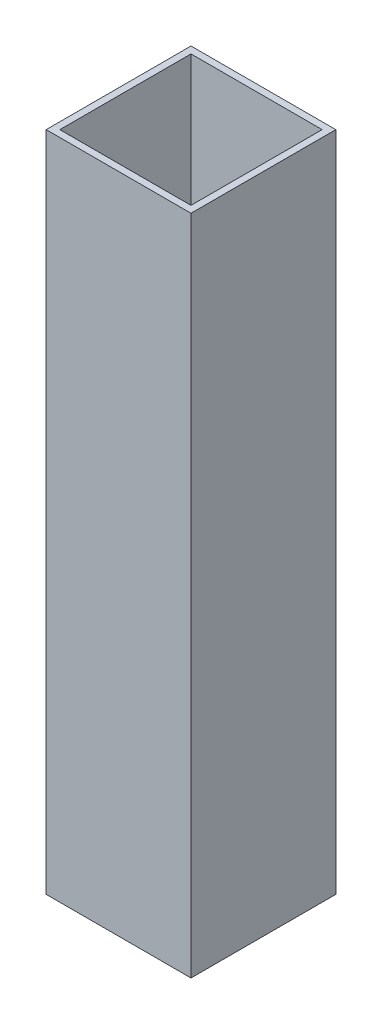
ISO-10303-21;
HEADER;
FILE_DESCRIPTION(('STEP AP214'),'2;1');
FILE_NAME('part.step','',(''),(''),'','','');
FILE_SCHEMA(('AUTOMOTIVE_DESIGN { 1 0 10303 214 1 1 1 1 }'));
ENDSEC;
DATA;
#1=APPLICATION_CONTEXT('core data for automotive mechanical design processes');
#2=APPLICATION_PROTOCOL_DEFINITION('international standard','automotive_design',2000,#1);
#3=PRODUCT_CONTEXT('',#1,'mechanical');
#4=PRODUCT('Part','Part','',(#3));
#5=PRODUCT_RELATED_PRODUCT_CATEGORY('part','',(#4));
#6=PRODUCT_DEFINITION_FORMATION('','',#4);
#7=PRODUCT_DEFINITION_CONTEXT('part definition',#1,'design');
#8=PRODUCT_DEFINITION('design','',#6,#7);
#9=PRODUCT_DEFINITION_SHAPE('','',#8);
#10=(LENGTH_UNIT() NAMED_UNIT(*) SI_UNIT(.MILLI.,.METRE.));
#11=(NAMED_UNIT(*) PLANE_ANGLE_UNIT() SI_UNIT($,.RADIAN.));
#12=(NAMED_UNIT(*) SI_UNIT($,.STERADIAN.) SOLID_ANGLE_UNIT());
#13=UNCERTAINTY_MEASURE_WITH_UNIT(LENGTH_MEASURE(1.E-05),#10,'distance_accuracy_value','');
#14=(GEOMETRIC_REPRESENTATION_CONTEXT(3) GLOBAL_UNCERTAINTY_ASSIGNED_CONTEXT((#13)) GLOBAL_UNIT_ASSIGNED_CONTEXT((#10,
#11,#12)) REPRESENTATION_CONTEXT('',''));
#15=CARTESIAN_POINT('',(0.,0.,0.));
#16=DIRECTION('',(0.,0.,1.));
#17=DIRECTION('',(1.,0.,0.));
#18=AXIS2_PLACEMENT_3D('',#15,#16,#17);
#19=CARTESIAN_POINT('',(0.,116.14,0.));
#20=DIRECTION('',(0.,1.,0.));
#21=DIRECTION('',(0.,0.,1.));
#22=AXIS2_PLACEMENT_3D('',#19,#20,#21);
#23=PLANE('',#22);
#24=DIRECTION('',(0.,0.,1.));
#25=VECTOR('',#24,1.);
#26=CARTESIAN_POINT('',(0.,116.14,-25.4));
#27=LINE('',#26,#25);
#28=CARTESIAN_POINT('',(0.,116.14,-25.4));
#29=VERTEX_POINT('',#28);
#30=CARTESIAN_POINT('',(0.,116.14,0.));
#31=VERTEX_POINT('',#30);
#32=EDGE_CURVE('E157',#29,#31,#27,.T.);
#33=ORIENTED_EDGE('',*,*,#32,.T.);
#34=DIRECTION('',(1.,0.,0.));
#35=VECTOR('',#34,1.);
#36=CARTESIAN_POINT('',(0.,116.14,0.));
#37=LINE('',#36,#35);
#38=CARTESIAN_POINT('',(25.4,116.14,0.));
#39=VERTEX_POINT('',#38);
#40=EDGE_CURVE('E161',#31,#39,#37,.T.);
#41=ORIENTED_EDGE('',*,*,#40,.T.);
#42=DIRECTION('',(0.,0.,-1.));
#43=VECTOR('',#42,1.);
#44=CARTESIAN_POINT('',(25.4,116.14,0.));
#45=LINE('',#44,#43);
#46=CARTESIAN_POINT('',(25.4,116.14,-25.4));
#47=VERTEX_POINT('',#46);
#48=EDGE_CURVE('E165',#39,#47,#45,.T.);
#49=ORIENTED_EDGE('',*,*,#48,.T.);
#50=DIRECTION('',(-1.,0.,0.));
#51=VECTOR('',#50,1.);
#52=CARTESIAN_POINT('',(25.4,116.14,-25.4));
#53=LINE('',#52,#51);
#54=EDGE_CURVE('E168',#47,#29,#53,.T.);
#55=ORIENTED_EDGE('',*,*,#54,.T.);
#56=EDGE_LOOP('',(#33,#41,#49,#55));
#57=FACE_BOUND('',#56,.T.);
#58=DIRECTION('',(0.,0.,1.));
#59=VECTOR('',#58,1.);
#60=CARTESIAN_POINT('',(1.2,116.14,-24.2));
#61=LINE('',#60,#59);
#62=CARTESIAN_POINT('',(1.2,116.14,-24.2));
#63=VERTEX_POINT('',#62);
#64=CARTESIAN_POINT('',(1.2,116.14,-1.2));
#65=VERTEX_POINT('',#64);
#66=EDGE_CURVE('E118',#63,#65,#61,.T.);
#67=ORIENTED_EDGE('',*,*,#66,.F.);
#68=DIRECTION('',(-1.,0.,0.));
#69=VECTOR('',#68,1.);
#70=CARTESIAN_POINT('',(24.2,116.14,-24.2));
#71=LINE('',#70,#69);
#72=CARTESIAN_POINT('',(24.2,116.14,-24.2));
#73=VERTEX_POINT('',#72);
#74=EDGE_CURVE('E109',#73,#63,#71,.T.);
#75=ORIENTED_EDGE('',*,*,#74,.F.);
#76=DIRECTION('',(0.,0.,-1.));
#77=VECTOR('',#76,1.);
#78=CARTESIAN_POINT('',(24.2,116.14,-1.2));
#79=LINE('',#78,#77);
#80=CARTESIAN_POINT('',(24.2,116.14,-1.2));
#81=VERTEX_POINT('',#80);
#82=EDGE_CURVE('E135',#81,#73,#79,.T.);
#83=ORIENTED_EDGE('',*,*,#82,.F.);
#84=DIRECTION('',(1.,0.,0.));
#85=VECTOR('',#84,1.);
#86=CARTESIAN_POINT('',(1.2,116.14,-1.2));
#87=LINE('',#86,#85);
#88=EDGE_CURVE('E131',#65,#81,#87,.T.);
#89=ORIENTED_EDGE('',*,*,#88,.F.);
#90=EDGE_LOOP('',(#67,#75,#83,#89));
#91=FACE_BOUND('',#90,.T.);
#92=ADVANCED_FACE('F43',(#57,#91),#23,.T.);
#93=CARTESIAN_POINT('',(0.,0.,0.));
#94=DIRECTION('',(0.,1.,0.));
#95=DIRECTION('',(0.,0.,1.));
#96=AXIS2_PLACEMENT_3D('',#93,#94,#95);
#97=PLANE('',#96);
#98=DIRECTION('',(0.,0.,1.));
#99=VECTOR('',#98,1.);
#100=CARTESIAN_POINT('',(0.,0.,-25.4));
#101=LINE('',#100,#99);
#102=CARTESIAN_POINT('',(0.,0.,-25.4));
#103=VERTEX_POINT('',#102);
#104=CARTESIAN_POINT('',(0.,0.,0.));
#105=VERTEX_POINT('',#104);
#106=EDGE_CURVE('E127',#103,#105,#101,.T.);
#107=ORIENTED_EDGE('',*,*,#106,.F.);
#108=DIRECTION('',(-1.,0.,0.));
#109=VECTOR('',#108,1.);
#110=CARTESIAN_POINT('',(25.4,0.,-25.4));
#111=LINE('',#110,#109);
#112=CARTESIAN_POINT('',(25.4,0.,-25.4));
#113=VERTEX_POINT('',#112);
#114=EDGE_CURVE('E162',#113,#103,#111,.T.);
#115=ORIENTED_EDGE('',*,*,#114,.F.);
#116=DIRECTION('',(0.,0.,-1.));
#117=VECTOR('',#116,1.);
#118=CARTESIAN_POINT('',(25.4,0.,0.));
#119=LINE('',#118,#117);
#120=CARTESIAN_POINT('',(25.4,0.,0.));
#121=VERTEX_POINT('',#120);
#122=EDGE_CURVE('E178',#121,#113,#119,.T.);
#123=ORIENTED_EDGE('',*,*,#122,.F.);
#124=DIRECTION('',(1.,0.,0.));
#125=VECTOR('',#124,1.);
#126=CARTESIAN_POINT('',(0.,0.,0.));
#127=LINE('',#126,#125);
#128=EDGE_CURVE('E175',#105,#121,#127,.T.);
#129=ORIENTED_EDGE('',*,*,#128,.F.);
#130=EDGE_LOOP('',(#107,#115,#123,#129));
#131=FACE_BOUND('',#130,.T.);
#132=DIRECTION('',(-1.,0.,0.));
#133=VECTOR('',#132,1.);
#134=CARTESIAN_POINT('',(24.2,0.,-24.2));
#135=LINE('',#134,#133);
#136=CARTESIAN_POINT('',(24.2,0.,-24.2));
#137=VERTEX_POINT('',#136);
#138=CARTESIAN_POINT('',(1.2,0.,-24.2));
#139=VERTEX_POINT('',#138);
#140=EDGE_CURVE('E67',#137,#139,#135,.T.);
#141=ORIENTED_EDGE('',*,*,#140,.T.);
#142=DIRECTION('',(0.,0.,1.));
#143=VECTOR('',#142,1.);
#144=CARTESIAN_POINT('',(1.2,0.,-24.2));
#145=LINE('',#144,#143);
#146=CARTESIAN_POINT('',(1.2,0.,-1.2));
#147=VERTEX_POINT('',#146);
#148=EDGE_CURVE('E125',#139,#147,#145,.T.);
#149=ORIENTED_EDGE('',*,*,#148,.T.);
#150=DIRECTION('',(1.,0.,0.));
#151=VECTOR('',#150,1.);
#152=CARTESIAN_POINT('',(1.2,0.,-1.2));
#153=LINE('',#152,#151);
#154=CARTESIAN_POINT('',(24.2,0.,-1.2));
#155=VERTEX_POINT('',#154);
#156=EDGE_CURVE('E144',#147,#155,#153,.T.);
#157=ORIENTED_EDGE('',*,*,#156,.T.);
#158=DIRECTION('',(0.,0.,-1.));
#159=VECTOR('',#158,1.);
#160=CARTESIAN_POINT('',(24.2,0.,-1.2));
#161=LINE('',#160,#159);
#162=EDGE_CURVE('E119',#155,#137,#161,.T.);
#163=ORIENTED_EDGE('',*,*,#162,.T.);
#164=EDGE_LOOP('',(#141,#149,#157,#163));
#165=FACE_BOUND('',#164,.T.);
#166=ADVANCED_FACE('F201',(#131,#165),#97,.F.);
#167=CARTESIAN_POINT('',(0.,116.14,-25.4));
#168=DIRECTION('',(1.,0.,0.));
#169=DIRECTION('',(0.,0.,-1.));
#170=AXIS2_PLACEMENT_3D('',#167,#168,#169);
#171=PLANE('',#170);
#172=ORIENTED_EDGE('',*,*,#106,.T.);
#173=DIRECTION('',(0.,-1.,0.));
#174=VECTOR('',#173,1.);
#175=CARTESIAN_POINT('',(0.,116.14,0.));
#176=LINE('',#175,#174);
#177=EDGE_CURVE('E11',#31,#105,#176,.T.);
#178=ORIENTED_EDGE('',*,*,#177,.F.);
#179=ORIENTED_EDGE('',*,*,#32,.F.);
#180=DIRECTION('',(0.,-1.,0.));
#181=VECTOR('',#180,1.);
#182=CARTESIAN_POINT('',(0.,116.14,-25.4));
#183=LINE('',#182,#181);
#184=EDGE_CURVE('E171',#29,#103,#183,.T.);
#185=ORIENTED_EDGE('',*,*,#184,.T.);
#186=EDGE_LOOP('',(#172,#178,#179,#185));
#187=FACE_BOUND('',#186,.T.);
#188=ADVANCED_FACE('F45',(#187),#171,.F.);
#189=CARTESIAN_POINT('',(0.,116.14,0.));
#190=DIRECTION('',(0.,0.,-1.));
#191=DIRECTION('',(-1.,0.,0.));
#192=AXIS2_PLACEMENT_3D('',#189,#190,#191);
#193=PLANE('',#192);
#194=ORIENTED_EDGE('',*,*,#128,.T.);
#195=DIRECTION('',(0.,-1.,0.));
#196=VECTOR('',#195,1.);
#197=CARTESIAN_POINT('',(25.4,116.14,0.));
#198=LINE('',#197,#196);
#199=EDGE_CURVE('E52',#39,#121,#198,.T.);
#200=ORIENTED_EDGE('',*,*,#199,.F.);
#201=ORIENTED_EDGE('',*,*,#40,.F.);
#202=ORIENTED_EDGE('',*,*,#177,.T.);
#203=EDGE_LOOP('',(#194,#200,#201,#202));
#204=FACE_BOUND('',#203,.T.);
#205=ADVANCED_FACE('F211',(#204),#193,.F.);
#206=CARTESIAN_POINT('',(25.4,116.14,0.));
#207=DIRECTION('',(-1.,0.,0.));
#208=DIRECTION('',(0.,0.,1.));
#209=AXIS2_PLACEMENT_3D('',#206,#207,#208);
#210=PLANE('',#209);
#211=ORIENTED_EDGE('',*,*,#122,.T.);
#212=DIRECTION('',(0.,-1.,0.));
#213=VECTOR('',#212,1.);
#214=CARTESIAN_POINT('',(25.4,116.14,-25.4));
#215=LINE('',#214,#213);
#216=EDGE_CURVE('E186',#47,#113,#215,.T.);
#217=ORIENTED_EDGE('',*,*,#216,.F.);
#218=ORIENTED_EDGE('',*,*,#48,.F.);
#219=ORIENTED_EDGE('',*,*,#199,.T.);
#220=EDGE_LOOP('',(#211,#217,#218,#219));
#221=FACE_BOUND('',#220,.T.);
#222=ADVANCED_FACE('F195',(#221),#210,.F.);
#223=CARTESIAN_POINT('',(25.4,116.14,-25.4));
#224=DIRECTION('',(0.,0.,1.));
#225=DIRECTION('',(1.,0.,0.));
#226=AXIS2_PLACEMENT_3D('',#223,#224,#225);
#227=PLANE('',#226);
#228=ORIENTED_EDGE('',*,*,#114,.T.);
#229=ORIENTED_EDGE('',*,*,#184,.F.);
#230=ORIENTED_EDGE('',*,*,#54,.F.);
#231=ORIENTED_EDGE('',*,*,#216,.T.);
#232=EDGE_LOOP('',(#228,#229,#230,#231));
#233=FACE_BOUND('',#232,.T.);
#234=ADVANCED_FACE('F205',(#233),#227,.F.);
#235=CARTESIAN_POINT('',(24.2,116.14,-24.2));
#236=DIRECTION('',(0.,0.,1.));
#237=DIRECTION('',(1.,0.,0.));
#238=AXIS2_PLACEMENT_3D('',#235,#236,#237);
#239=PLANE('',#238);
#240=ORIENTED_EDGE('',*,*,#140,.F.);
#241=DIRECTION('',(0.,-1.,0.));
#242=VECTOR('',#241,1.);
#243=CARTESIAN_POINT('',(24.2,116.14,-24.2));
#244=LINE('',#243,#242);
#245=EDGE_CURVE('E113',#73,#137,#244,.T.);
#246=ORIENTED_EDGE('',*,*,#245,.F.);
#247=ORIENTED_EDGE('',*,*,#74,.T.);
#248=DIRECTION('',(0.,-1.,0.));
#249=VECTOR('',#248,1.);
#250=CARTESIAN_POINT('',(1.2,116.14,-24.2));
#251=LINE('',#250,#249);
#252=EDGE_CURVE('E112',#63,#139,#251,.T.);
#253=ORIENTED_EDGE('',*,*,#252,.T.);
#254=EDGE_LOOP('',(#240,#246,#247,#253));
#255=FACE_BOUND('',#254,.T.);
#256=ADVANCED_FACE('F111',(#255),#239,.T.);
#257=CARTESIAN_POINT('',(1.2,116.14,-24.2));
#258=DIRECTION('',(1.,0.,0.));
#259=DIRECTION('',(0.,0.,-1.));
#260=AXIS2_PLACEMENT_3D('',#257,#258,#259);
#261=PLANE('',#260);
#262=ORIENTED_EDGE('',*,*,#148,.F.);
#263=ORIENTED_EDGE('',*,*,#252,.F.);
#264=ORIENTED_EDGE('',*,*,#66,.T.);
#265=DIRECTION('',(0.,-1.,0.));
#266=VECTOR('',#265,1.);
#267=CARTESIAN_POINT('',(1.2,116.14,-1.2));
#268=LINE('',#267,#266);
#269=EDGE_CURVE('E128',#65,#147,#268,.T.);
#270=ORIENTED_EDGE('',*,*,#269,.T.);
#271=EDGE_LOOP('',(#262,#263,#264,#270));
#272=FACE_BOUND('',#271,.T.);
#273=ADVANCED_FACE('F122',(#272),#261,.T.);
#274=CARTESIAN_POINT('',(1.2,116.14,-1.2));
#275=DIRECTION('',(0.,0.,-1.));
#276=DIRECTION('',(-1.,0.,0.));
#277=AXIS2_PLACEMENT_3D('',#274,#275,#276);
#278=PLANE('',#277);
#279=ORIENTED_EDGE('',*,*,#156,.F.);
#280=ORIENTED_EDGE('',*,*,#269,.F.);
#281=ORIENTED_EDGE('',*,*,#88,.T.);
#282=DIRECTION('',(0.,-1.,0.));
#283=VECTOR('',#282,1.);
#284=CARTESIAN_POINT('',(24.2,116.14,-1.2));
#285=LINE('',#284,#283);
#286=EDGE_CURVE('E59',#81,#155,#285,.T.);
#287=ORIENTED_EDGE('',*,*,#286,.T.);
#288=EDGE_LOOP('',(#279,#280,#281,#287));
#289=FACE_BOUND('',#288,.T.);
#290=ADVANCED_FACE('F234',(#289),#278,.T.);
#291=CARTESIAN_POINT('',(24.2,116.14,-1.2));
#292=DIRECTION('',(-1.,0.,0.));
#293=DIRECTION('',(0.,0.,1.));
#294=AXIS2_PLACEMENT_3D('',#291,#292,#293);
#295=PLANE('',#294);
#296=ORIENTED_EDGE('',*,*,#162,.F.);
#297=ORIENTED_EDGE('',*,*,#286,.F.);
#298=ORIENTED_EDGE('',*,*,#82,.T.);
#299=ORIENTED_EDGE('',*,*,#245,.T.);
#300=EDGE_LOOP('',(#296,#297,#298,#299));
#301=FACE_BOUND('',#300,.T.);
#302=ADVANCED_FACE('F238',(#301),#295,.T.);
#303=CLOSED_SHELL('',(#92,#166,#188,#205,#222,#234,#256,#273,#290,#302));
#304=MANIFOLD_SOLID_BREP('B2',#303);
#305=ADVANCED_BREP_SHAPE_REPRESENTATION('',(#18,#304),#14);
#306=SHAPE_DEFINITION_REPRESENTATION(#9,#305);
ENDSEC;
END-ISO-10303-21;
